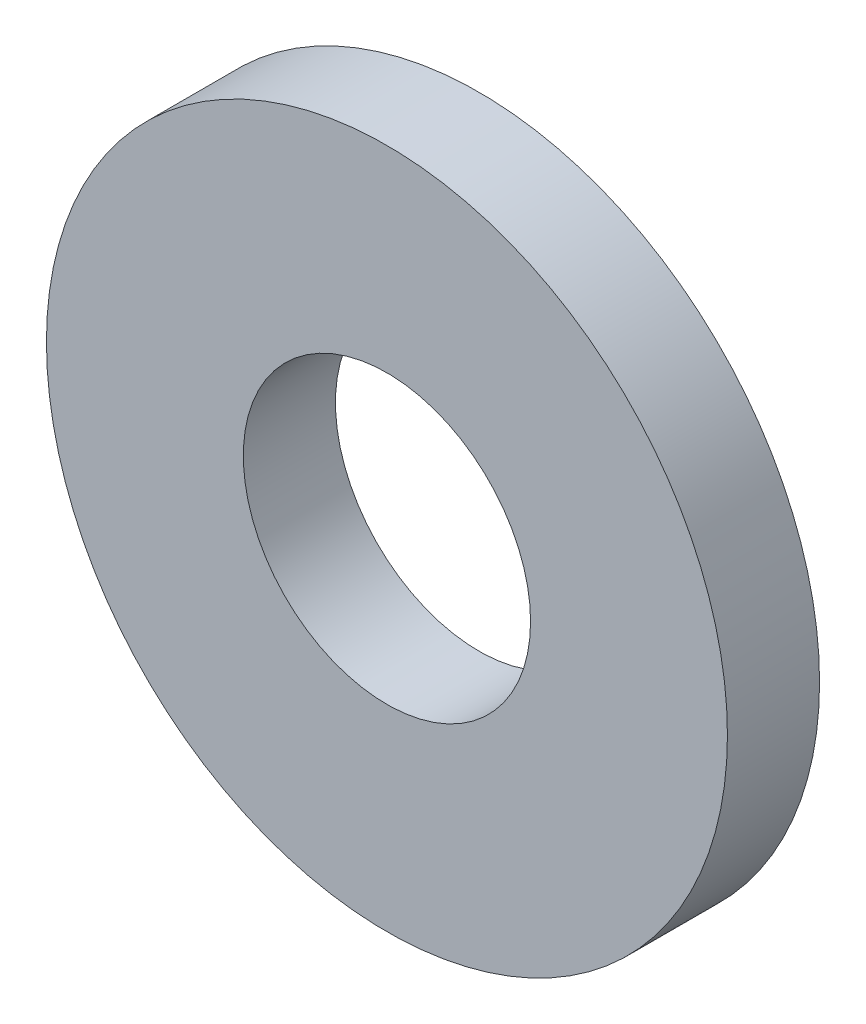
ISO-10303-21;
HEADER;
FILE_DESCRIPTION(('STEP AP214'),'2;1');
FILE_NAME('part.step','',(''),(''),'','','');
FILE_SCHEMA(('AUTOMOTIVE_DESIGN { 1 0 10303 214 1 1 1 1 }'));
ENDSEC;
DATA;
#1=APPLICATION_CONTEXT('core data for automotive mechanical design processes');
#2=APPLICATION_PROTOCOL_DEFINITION('international standard','automotive_design',2000,#1);
#3=PRODUCT_CONTEXT('',#1,'mechanical');
#4=PRODUCT('Part','Part','',(#3));
#5=PRODUCT_RELATED_PRODUCT_CATEGORY('part','',(#4));
#6=PRODUCT_DEFINITION_FORMATION('','',#4);
#7=PRODUCT_DEFINITION_CONTEXT('part definition',#1,'design');
#8=PRODUCT_DEFINITION('design','',#6,#7);
#9=PRODUCT_DEFINITION_SHAPE('','',#8);
#10=(LENGTH_UNIT() NAMED_UNIT(*) SI_UNIT(.MILLI.,.METRE.));
#11=(NAMED_UNIT(*) PLANE_ANGLE_UNIT() SI_UNIT($,.RADIAN.));
#12=(NAMED_UNIT(*) SI_UNIT($,.STERADIAN.) SOLID_ANGLE_UNIT());
#13=UNCERTAINTY_MEASURE_WITH_UNIT(LENGTH_MEASURE(1.E-05),#10,'distance_accuracy_value','');
#14=(GEOMETRIC_REPRESENTATION_CONTEXT(3) GLOBAL_UNCERTAINTY_ASSIGNED_CONTEXT((#13)) GLOBAL_UNIT_ASSIGNED_CONTEXT((#10,
#11,#12)) REPRESENTATION_CONTEXT('',''));
#15=CARTESIAN_POINT('',(0.,0.,0.));
#16=DIRECTION('',(0.,0.,1.));
#17=DIRECTION('',(1.,0.,0.));
#18=AXIS2_PLACEMENT_3D('',#15,#16,#17);
#19=CARTESIAN_POINT('',(0.,0.,-2.3622));
#20=DIRECTION('',(0.,0.,1.));
#21=DIRECTION('',(1.,0.,0.));
#22=AXIS2_PLACEMENT_3D('',#19,#20,#21);
#23=CYLINDRICAL_SURFACE('',#22,8.73125);
#24=CARTESIAN_POINT('',(0.,0.,-2.3622));
#25=DIRECTION('',(0.,0.,1.));
#26=DIRECTION('',(1.,0.,0.));
#27=AXIS2_PLACEMENT_3D('',#24,#25,#26);
#28=CIRCLE('',#27,8.73125);
#29=CARTESIAN_POINT('',(8.73125,0.,-2.3622));
#30=VERTEX_POINT('',#29);
#31=EDGE_CURVE('E10',#30,#30,#28,.T.);
#32=ORIENTED_EDGE('',*,*,#31,.T.);
#33=EDGE_LOOP('',(#32));
#34=FACE_BOUND('',#33,.T.);
#35=CARTESIAN_POINT('',(0.,0.,0.));
#36=DIRECTION('',(0.,0.,1.));
#37=DIRECTION('',(1.,0.,0.));
#38=AXIS2_PLACEMENT_3D('',#35,#36,#37);
#39=CIRCLE('',#38,8.73125);
#40=CARTESIAN_POINT('',(8.73125,0.,0.));
#41=VERTEX_POINT('',#40);
#42=EDGE_CURVE('E31',#41,#41,#39,.T.);
#43=ORIENTED_EDGE('',*,*,#42,.F.);
#44=EDGE_LOOP('',(#43));
#45=FACE_BOUND('',#44,.T.);
#46=ADVANCED_FACE('F28',(#34,#45),#23,.T.);
#47=CARTESIAN_POINT('',(0.,0.,-2.3622));
#48=DIRECTION('',(0.,0.,1.));
#49=DIRECTION('',(1.,0.,0.));
#50=AXIS2_PLACEMENT_3D('',#47,#48,#49);
#51=PLANE('',#50);
#52=CARTESIAN_POINT('',(0.,0.,-2.3622));
#53=DIRECTION('',(0.,0.,1.));
#54=DIRECTION('',(1.,0.,0.));
#55=AXIS2_PLACEMENT_3D('',#52,#53,#54);
#56=CIRCLE('',#55,3.683);
#57=CARTESIAN_POINT('',(3.683,0.,-2.3622));
#58=VERTEX_POINT('',#57);
#59=EDGE_CURVE('E38',#58,#58,#56,.T.);
#60=ORIENTED_EDGE('',*,*,#59,.T.);
#61=EDGE_LOOP('',(#60));
#62=FACE_BOUND('',#61,.T.);
#63=ORIENTED_EDGE('',*,*,#31,.F.);
#64=EDGE_LOOP('',(#63));
#65=FACE_BOUND('',#64,.T.);
#66=ADVANCED_FACE('F46',(#62,#65),#51,.F.);
#67=CARTESIAN_POINT('',(0.,0.,0.));
#68=DIRECTION('',(0.,0.,1.));
#69=DIRECTION('',(1.,0.,0.));
#70=AXIS2_PLACEMENT_3D('',#67,#68,#69);
#71=PLANE('',#70);
#72=CARTESIAN_POINT('',(0.,0.,0.));
#73=DIRECTION('',(0.,0.,1.));
#74=DIRECTION('',(1.,0.,0.));
#75=AXIS2_PLACEMENT_3D('',#72,#73,#74);
#76=CIRCLE('',#75,3.683);
#77=CARTESIAN_POINT('',(3.683,0.,0.));
#78=VERTEX_POINT('',#77);
#79=EDGE_CURVE('E40',#78,#78,#76,.T.);
#80=ORIENTED_EDGE('',*,*,#79,.F.);
#81=EDGE_LOOP('',(#80));
#82=FACE_BOUND('',#81,.T.);
#83=ORIENTED_EDGE('',*,*,#42,.T.);
#84=EDGE_LOOP('',(#83));
#85=FACE_BOUND('',#84,.T.);
#86=ADVANCED_FACE('F52',(#82,#85),#71,.T.);
#87=CARTESIAN_POINT('',(0.,0.,-2.3622));
#88=DIRECTION('',(0.,0.,1.));
#89=DIRECTION('',(1.,0.,0.));
#90=AXIS2_PLACEMENT_3D('',#87,#88,#89);
#91=CYLINDRICAL_SURFACE('',#90,3.683);
#92=ORIENTED_EDGE('',*,*,#59,.F.);
#93=EDGE_LOOP('',(#92));
#94=FACE_BOUND('',#93,.T.);
#95=ORIENTED_EDGE('',*,*,#79,.T.);
#96=EDGE_LOOP('',(#95));
#97=FACE_BOUND('',#96,.T.);
#98=ADVANCED_FACE('F49',(#94,#97),#91,.F.);
#99=CLOSED_SHELL('',(#46,#66,#86,#98));
#100=MANIFOLD_SOLID_BREP('B2',#99);
#101=ADVANCED_BREP_SHAPE_REPRESENTATION('',(#18,#100),#14);
#102=SHAPE_DEFINITION_REPRESENTATION(#9,#101);
ENDSEC;
END-ISO-10303-21;
